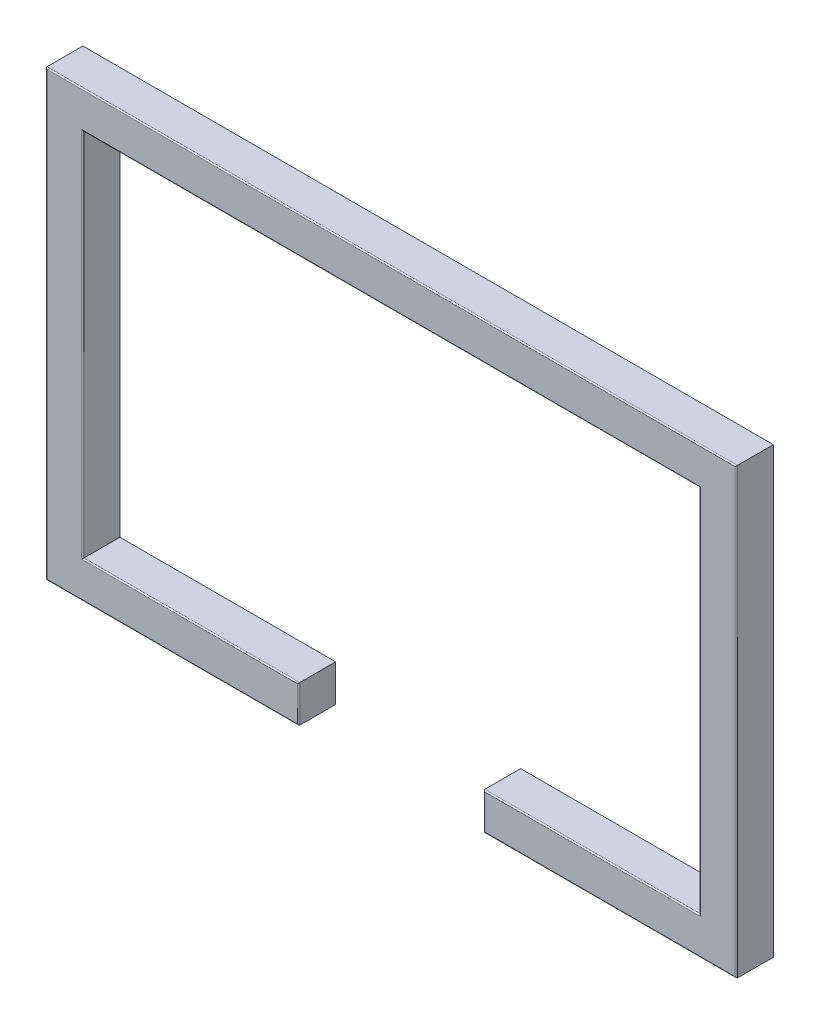
ISO-10303-21;
HEADER;
FILE_DESCRIPTION(('STEP AP214'),'2;1');
FILE_NAME('part.step','',(''),(''),'','','');
FILE_SCHEMA(('AUTOMOTIVE_DESIGN { 1 0 10303 214 1 1 1 1 }'));
ENDSEC;
DATA;
#1=APPLICATION_CONTEXT('core data for automotive mechanical design processes');
#2=APPLICATION_PROTOCOL_DEFINITION('international standard','automotive_design',2000,#1);
#3=PRODUCT_CONTEXT('',#1,'mechanical');
#4=PRODUCT('Part','Part','',(#3));
#5=PRODUCT_RELATED_PRODUCT_CATEGORY('part','',(#4));
#6=PRODUCT_DEFINITION_FORMATION('','',#4);
#7=PRODUCT_DEFINITION_CONTEXT('part definition',#1,'design');
#8=PRODUCT_DEFINITION('design','',#6,#7);
#9=PRODUCT_DEFINITION_SHAPE('','',#8);
#10=(LENGTH_UNIT() NAMED_UNIT(*) SI_UNIT(.MILLI.,.METRE.));
#11=(NAMED_UNIT(*) PLANE_ANGLE_UNIT() SI_UNIT($,.RADIAN.));
#12=(NAMED_UNIT(*) SI_UNIT($,.STERADIAN.) SOLID_ANGLE_UNIT());
#13=UNCERTAINTY_MEASURE_WITH_UNIT(LENGTH_MEASURE(1.E-05),#10,'distance_accuracy_value','');
#14=(GEOMETRIC_REPRESENTATION_CONTEXT(3) GLOBAL_UNCERTAINTY_ASSIGNED_CONTEXT((#13)) GLOBAL_UNIT_ASSIGNED_CONTEXT((#10,
#11,#12)) REPRESENTATION_CONTEXT('',''));
#15=CARTESIAN_POINT('',(0.,0.,0.));
#16=DIRECTION('',(0.,0.,1.));
#17=DIRECTION('',(1.,0.,0.));
#18=AXIS2_PLACEMENT_3D('',#15,#16,#17);
#19=CARTESIAN_POINT('',(75.,-150.,30.));
#20=DIRECTION('',(0.,-1.,0.));
#21=DIRECTION('',(0.,0.,-1.));
#22=AXIS2_PLACEMENT_3D('',#19,#20,#21);
#23=PLANE('',#22);
#24=DIRECTION('',(0.,0.,-1.));
#25=VECTOR('',#24,1.);
#26=CARTESIAN_POINT('',(75.,-150.,30.));
#27=LINE('',#26,#25);
#28=CARTESIAN_POINT('',(75.,-150.,29.));
#29=VERTEX_POINT('',#28);
#30=CARTESIAN_POINT('',(75.,-150.,0.));
#31=VERTEX_POINT('',#30);
#32=EDGE_CURVE('E159',#29,#31,#27,.T.);
#33=ORIENTED_EDGE('',*,*,#32,.F.);
#34=DIRECTION('',(-1.,0.,0.));
#35=VECTOR('',#34,1.);
#36=CARTESIAN_POINT('',(75.,-150.,29.));
#37=LINE('',#36,#35);
#38=CARTESIAN_POINT('',(250.,-150.,29.));
#39=VERTEX_POINT('',#38);
#40=EDGE_CURVE('E271',#29,#39,#37,.F.);
#41=ORIENTED_EDGE('',*,*,#40,.T.);
#42=DIRECTION('',(0.,0.,-1.));
#43=VECTOR('',#42,1.);
#44=CARTESIAN_POINT('',(250.,-150.,30.));
#45=LINE('',#44,#43);
#46=CARTESIAN_POINT('',(250.,-150.,0.));
#47=VERTEX_POINT('',#46);
#48=EDGE_CURVE('E183',#39,#47,#45,.T.);
#49=ORIENTED_EDGE('',*,*,#48,.T.);
#50=DIRECTION('',(-1.,0.,0.));
#51=VECTOR('',#50,1.);
#52=CARTESIAN_POINT('',(75.,-150.,0.));
#53=LINE('',#52,#51);
#54=EDGE_CURVE('E177',#47,#31,#53,.T.);
#55=ORIENTED_EDGE('',*,*,#54,.T.);
#56=EDGE_LOOP('',(#33,#41,#49,#55));
#57=FACE_BOUND('',#56,.T.);
#58=ADVANCED_FACE('F33',(#57),#23,.F.);
#59=CARTESIAN_POINT('',(75.,-180.,30.));
#60=DIRECTION('',(1.,0.,0.));
#61=DIRECTION('',(0.,0.,-1.));
#62=AXIS2_PLACEMENT_3D('',#59,#60,#61);
#63=PLANE('',#62);
#64=DIRECTION('',(0.,0.,-1.));
#65=VECTOR('',#64,1.);
#66=CARTESIAN_POINT('',(75.,-180.,30.));
#67=LINE('',#66,#65);
#68=CARTESIAN_POINT('',(75.,-180.,29.));
#69=VERTEX_POINT('',#68);
#70=CARTESIAN_POINT('',(75.,-180.,0.));
#71=VERTEX_POINT('',#70);
#72=EDGE_CURVE('E171',#69,#71,#67,.T.);
#73=ORIENTED_EDGE('',*,*,#72,.F.);
#74=DIRECTION('',(0.,-1.,0.));
#75=VECTOR('',#74,1.);
#76=CARTESIAN_POINT('',(75.,-180.,29.));
#77=LINE('',#76,#75);
#78=EDGE_CURVE('E166',#69,#29,#77,.F.);
#79=ORIENTED_EDGE('',*,*,#78,.T.);
#80=ORIENTED_EDGE('',*,*,#32,.T.);
#81=DIRECTION('',(0.,-1.,0.));
#82=VECTOR('',#81,1.);
#83=CARTESIAN_POINT('',(75.,-180.,0.));
#84=LINE('',#83,#82);
#85=EDGE_CURVE('E163',#31,#71,#84,.T.);
#86=ORIENTED_EDGE('',*,*,#85,.T.);
#87=EDGE_LOOP('',(#73,#79,#80,#86));
#88=FACE_BOUND('',#87,.T.);
#89=ADVANCED_FACE('F162',(#88),#63,.F.);
#90=CARTESIAN_POINT('',(75.,-180.,30.));
#91=DIRECTION('',(0.,1.,0.));
#92=DIRECTION('',(0.,0.,1.));
#93=AXIS2_PLACEMENT_3D('',#90,#91,#92);
#94=PLANE('',#93);
#95=DIRECTION('',(0.,0.,-1.));
#96=VECTOR('',#95,1.);
#97=CARTESIAN_POINT('',(280.,-180.,30.));
#98=LINE('',#97,#96);
#99=CARTESIAN_POINT('',(280.,-180.,29.));
#100=VERTEX_POINT('',#99);
#101=CARTESIAN_POINT('',(280.,-180.,0.));
#102=VERTEX_POINT('',#101);
#103=EDGE_CURVE('E233',#100,#102,#98,.T.);
#104=ORIENTED_EDGE('',*,*,#103,.F.);
#105=DIRECTION('',(1.,0.,0.));
#106=VECTOR('',#105,1.);
#107=CARTESIAN_POINT('',(75.,-180.,29.));
#108=LINE('',#107,#106);
#109=EDGE_CURVE('E276',#100,#69,#108,.F.);
#110=ORIENTED_EDGE('',*,*,#109,.T.);
#111=ORIENTED_EDGE('',*,*,#72,.T.);
#112=DIRECTION('',(1.,0.,0.));
#113=VECTOR('',#112,1.);
#114=CARTESIAN_POINT('',(75.,-180.,0.));
#115=LINE('',#114,#113);
#116=EDGE_CURVE('E180',#71,#102,#115,.T.);
#117=ORIENTED_EDGE('',*,*,#116,.T.);
#118=EDGE_LOOP('',(#104,#110,#111,#117));
#119=FACE_BOUND('',#118,.T.);
#120=ADVANCED_FACE('F358',(#119),#94,.F.);
#121=CARTESIAN_POINT('',(280.,180.,30.));
#122=DIRECTION('',(-1.,0.,0.));
#123=DIRECTION('',(0.,0.,1.));
#124=AXIS2_PLACEMENT_3D('',#121,#122,#123);
#125=PLANE('',#124);
#126=DIRECTION('',(0.,0.,-1.));
#127=VECTOR('',#126,1.);
#128=CARTESIAN_POINT('',(280.,180.,30.));
#129=LINE('',#128,#127);
#130=CARTESIAN_POINT('',(280.,180.,29.));
#131=VERTEX_POINT('',#130);
#132=CARTESIAN_POINT('',(280.,180.,0.));
#133=VERTEX_POINT('',#132);
#134=EDGE_CURVE('E231',#131,#133,#129,.T.);
#135=ORIENTED_EDGE('',*,*,#134,.F.);
#136=DIRECTION('',(0.,1.,0.));
#137=VECTOR('',#136,1.);
#138=CARTESIAN_POINT('',(280.,180.,29.));
#139=LINE('',#138,#137);
#140=EDGE_CURVE('E274',#131,#100,#139,.F.);
#141=ORIENTED_EDGE('',*,*,#140,.T.);
#142=ORIENTED_EDGE('',*,*,#103,.T.);
#143=DIRECTION('',(0.,1.,0.));
#144=VECTOR('',#143,1.);
#145=CARTESIAN_POINT('',(280.,180.,0.));
#146=LINE('',#145,#144);
#147=EDGE_CURVE('E190',#102,#133,#146,.T.);
#148=ORIENTED_EDGE('',*,*,#147,.T.);
#149=EDGE_LOOP('',(#135,#141,#142,#148));
#150=FACE_BOUND('',#149,.T.);
#151=ADVANCED_FACE('F434',(#150),#125,.F.);
#152=CARTESIAN_POINT('',(-280.,180.,30.));
#153=DIRECTION('',(0.,-1.,0.));
#154=DIRECTION('',(0.,0.,-1.));
#155=AXIS2_PLACEMENT_3D('',#152,#153,#154);
#156=PLANE('',#155);
#157=DIRECTION('',(0.,0.,-1.));
#158=VECTOR('',#157,1.);
#159=CARTESIAN_POINT('',(-280.,180.,30.));
#160=LINE('',#159,#158);
#161=CARTESIAN_POINT('',(-280.,180.,29.));
#162=VERTEX_POINT('',#161);
#163=CARTESIAN_POINT('',(-280.,180.,0.));
#164=VERTEX_POINT('',#163);
#165=EDGE_CURVE('E229',#162,#164,#160,.T.);
#166=ORIENTED_EDGE('',*,*,#165,.F.);
#167=DIRECTION('',(-1.,0.,0.));
#168=VECTOR('',#167,1.);
#169=CARTESIAN_POINT('',(-280.,180.,29.));
#170=LINE('',#169,#168);
#171=EDGE_CURVE('E11',#162,#131,#170,.F.);
#172=ORIENTED_EDGE('',*,*,#171,.T.);
#173=ORIENTED_EDGE('',*,*,#134,.T.);
#174=DIRECTION('',(-1.,0.,0.));
#175=VECTOR('',#174,1.);
#176=CARTESIAN_POINT('',(-280.,180.,0.));
#177=LINE('',#176,#175);
#178=EDGE_CURVE('E193',#133,#164,#177,.T.);
#179=ORIENTED_EDGE('',*,*,#178,.T.);
#180=EDGE_LOOP('',(#166,#172,#173,#179));
#181=FACE_BOUND('',#180,.T.);
#182=ADVANCED_FACE('F431',(#181),#156,.F.);
#183=CARTESIAN_POINT('',(-280.,180.,30.));
#184=DIRECTION('',(1.,0.,0.));
#185=DIRECTION('',(0.,0.,-1.));
#186=AXIS2_PLACEMENT_3D('',#183,#184,#185);
#187=PLANE('',#186);
#188=DIRECTION('',(0.,0.,-1.));
#189=VECTOR('',#188,1.);
#190=CARTESIAN_POINT('',(-280.,-180.,30.));
#191=LINE('',#190,#189);
#192=CARTESIAN_POINT('',(-280.,-180.,29.));
#193=VERTEX_POINT('',#192);
#194=CARTESIAN_POINT('',(-280.,-180.,0.));
#195=VERTEX_POINT('',#194);
#196=EDGE_CURVE('E227',#193,#195,#191,.T.);
#197=ORIENTED_EDGE('',*,*,#196,.F.);
#198=DIRECTION('',(0.,-1.,0.));
#199=VECTOR('',#198,1.);
#200=CARTESIAN_POINT('',(-280.,180.,29.));
#201=LINE('',#200,#199);
#202=EDGE_CURVE('E42',#193,#162,#201,.F.);
#203=ORIENTED_EDGE('',*,*,#202,.T.);
#204=ORIENTED_EDGE('',*,*,#165,.T.);
#205=DIRECTION('',(0.,-1.,0.));
#206=VECTOR('',#205,1.);
#207=CARTESIAN_POINT('',(-280.,180.,0.));
#208=LINE('',#207,#206);
#209=EDGE_CURVE('E196',#164,#195,#208,.T.);
#210=ORIENTED_EDGE('',*,*,#209,.T.);
#211=EDGE_LOOP('',(#197,#203,#204,#210));
#212=FACE_BOUND('',#211,.T.);
#213=ADVANCED_FACE('F429',(#212),#187,.F.);
#214=CARTESIAN_POINT('',(-280.,-180.,30.));
#215=DIRECTION('',(0.,1.,0.));
#216=DIRECTION('',(-1.,0.,0.));
#217=AXIS2_PLACEMENT_3D('',#214,#215,#216);
#218=PLANE('',#217);
#219=DIRECTION('',(0.,0.,-1.));
#220=VECTOR('',#219,1.);
#221=CARTESIAN_POINT('',(-75.,-180.,30.));
#222=LINE('',#221,#220);
#223=CARTESIAN_POINT('',(-75.,-180.,29.));
#224=VERTEX_POINT('',#223);
#225=CARTESIAN_POINT('',(-75.,-180.,0.));
#226=VERTEX_POINT('',#225);
#227=EDGE_CURVE('E225',#224,#226,#222,.T.);
#228=ORIENTED_EDGE('',*,*,#227,.F.);
#229=DIRECTION('',(1.,0.,0.));
#230=VECTOR('',#229,1.);
#231=CARTESIAN_POINT('',(-280.,-180.,29.));
#232=LINE('',#231,#230);
#233=EDGE_CURVE('E57',#224,#193,#232,.F.);
#234=ORIENTED_EDGE('',*,*,#233,.T.);
#235=ORIENTED_EDGE('',*,*,#196,.T.);
#236=DIRECTION('',(1.,0.,0.));
#237=VECTOR('',#236,1.);
#238=CARTESIAN_POINT('',(-280.,-180.,0.));
#239=LINE('',#238,#237);
#240=EDGE_CURVE('E199',#195,#226,#239,.T.);
#241=ORIENTED_EDGE('',*,*,#240,.T.);
#242=EDGE_LOOP('',(#228,#234,#235,#241));
#243=FACE_BOUND('',#242,.T.);
#244=ADVANCED_FACE('F428',(#243),#218,.F.);
#245=CARTESIAN_POINT('',(-75.,-180.,30.));
#246=DIRECTION('',(-1.,0.,0.));
#247=DIRECTION('',(0.,0.,1.));
#248=AXIS2_PLACEMENT_3D('',#245,#246,#247);
#249=PLANE('',#248);
#250=DIRECTION('',(0.,0.,-1.));
#251=VECTOR('',#250,1.);
#252=CARTESIAN_POINT('',(-75.,-150.,30.));
#253=LINE('',#252,#251);
#254=CARTESIAN_POINT('',(-75.,-150.,29.));
#255=VERTEX_POINT('',#254);
#256=CARTESIAN_POINT('',(-75.,-150.,0.));
#257=VERTEX_POINT('',#256);
#258=EDGE_CURVE('E223',#255,#257,#253,.T.);
#259=ORIENTED_EDGE('',*,*,#258,.F.);
#260=DIRECTION('',(0.,1.,0.));
#261=VECTOR('',#260,1.);
#262=CARTESIAN_POINT('',(-75.,-180.,29.));
#263=LINE('',#262,#261);
#264=EDGE_CURVE('E260',#255,#224,#263,.F.);
#265=ORIENTED_EDGE('',*,*,#264,.T.);
#266=ORIENTED_EDGE('',*,*,#227,.T.);
#267=DIRECTION('',(0.,1.,0.));
#268=VECTOR('',#267,1.);
#269=CARTESIAN_POINT('',(-75.,-180.,0.));
#270=LINE('',#269,#268);
#271=EDGE_CURVE('E202',#226,#257,#270,.T.);
#272=ORIENTED_EDGE('',*,*,#271,.T.);
#273=EDGE_LOOP('',(#259,#265,#266,#272));
#274=FACE_BOUND('',#273,.T.);
#275=ADVANCED_FACE('F423',(#274),#249,.F.);
#276=CARTESIAN_POINT('',(-250.,-150.,30.));
#277=DIRECTION('',(0.,-1.,0.));
#278=DIRECTION('',(0.,0.,-1.));
#279=AXIS2_PLACEMENT_3D('',#276,#277,#278);
#280=PLANE('',#279);
#281=DIRECTION('',(0.,0.,-1.));
#282=VECTOR('',#281,1.);
#283=CARTESIAN_POINT('',(-250.,-150.,30.));
#284=LINE('',#283,#282);
#285=CARTESIAN_POINT('',(-250.,-150.,29.));
#286=VERTEX_POINT('',#285);
#287=CARTESIAN_POINT('',(-250.,-150.,0.));
#288=VERTEX_POINT('',#287);
#289=EDGE_CURVE('E221',#286,#288,#284,.T.);
#290=ORIENTED_EDGE('',*,*,#289,.F.);
#291=DIRECTION('',(-1.,0.,0.));
#292=VECTOR('',#291,1.);
#293=CARTESIAN_POINT('',(-250.,-150.,29.));
#294=LINE('',#293,#292);
#295=EDGE_CURVE('E263',#286,#255,#294,.F.);
#296=ORIENTED_EDGE('',*,*,#295,.T.);
#297=ORIENTED_EDGE('',*,*,#258,.T.);
#298=DIRECTION('',(-1.,0.,0.));
#299=VECTOR('',#298,1.);
#300=CARTESIAN_POINT('',(-250.,-150.,0.));
#301=LINE('',#300,#299);
#302=EDGE_CURVE('E205',#257,#288,#301,.T.);
#303=ORIENTED_EDGE('',*,*,#302,.T.);
#304=EDGE_LOOP('',(#290,#296,#297,#303));
#305=FACE_BOUND('',#304,.T.);
#306=ADVANCED_FACE('F421',(#305),#280,.F.);
#307=CARTESIAN_POINT('',(-250.,150.,30.));
#308=DIRECTION('',(-1.,0.,0.));
#309=DIRECTION('',(0.,-1.,0.));
#310=AXIS2_PLACEMENT_3D('',#307,#308,#309);
#311=PLANE('',#310);
#312=DIRECTION('',(0.,0.,-1.));
#313=VECTOR('',#312,1.);
#314=CARTESIAN_POINT('',(-250.,150.,30.));
#315=LINE('',#314,#313);
#316=CARTESIAN_POINT('',(-250.,150.,29.));
#317=VERTEX_POINT('',#316);
#318=CARTESIAN_POINT('',(-250.,150.,0.));
#319=VERTEX_POINT('',#318);
#320=EDGE_CURVE('E219',#317,#319,#315,.T.);
#321=ORIENTED_EDGE('',*,*,#320,.F.);
#322=DIRECTION('',(0.,1.,0.));
#323=VECTOR('',#322,1.);
#324=CARTESIAN_POINT('',(-250.,150.,29.));
#325=LINE('',#324,#323);
#326=EDGE_CURVE('E265',#317,#286,#325,.F.);
#327=ORIENTED_EDGE('',*,*,#326,.T.);
#328=ORIENTED_EDGE('',*,*,#289,.T.);
#329=DIRECTION('',(0.,1.,0.));
#330=VECTOR('',#329,1.);
#331=CARTESIAN_POINT('',(-250.,150.,0.));
#332=LINE('',#331,#330);
#333=EDGE_CURVE('E208',#288,#319,#332,.T.);
#334=ORIENTED_EDGE('',*,*,#333,.T.);
#335=EDGE_LOOP('',(#321,#327,#328,#334));
#336=FACE_BOUND('',#335,.T.);
#337=ADVANCED_FACE('F336',(#336),#311,.F.);
#338=CARTESIAN_POINT('',(-250.,150.,30.));
#339=DIRECTION('',(0.,1.,0.));
#340=DIRECTION('',(0.,0.,1.));
#341=AXIS2_PLACEMENT_3D('',#338,#339,#340);
#342=PLANE('',#341);
#343=DIRECTION('',(0.,0.,-1.));
#344=VECTOR('',#343,1.);
#345=CARTESIAN_POINT('',(250.,150.,30.));
#346=LINE('',#345,#344);
#347=CARTESIAN_POINT('',(250.,150.,29.));
#348=VERTEX_POINT('',#347);
#349=CARTESIAN_POINT('',(250.,150.,0.));
#350=VERTEX_POINT('',#349);
#351=EDGE_CURVE('E217',#348,#350,#346,.T.);
#352=ORIENTED_EDGE('',*,*,#351,.F.);
#353=DIRECTION('',(1.,0.,0.));
#354=VECTOR('',#353,1.);
#355=CARTESIAN_POINT('',(-250.,150.,29.));
#356=LINE('',#355,#354);
#357=EDGE_CURVE('E267',#348,#317,#356,.F.);
#358=ORIENTED_EDGE('',*,*,#357,.T.);
#359=ORIENTED_EDGE('',*,*,#320,.T.);
#360=DIRECTION('',(1.,0.,0.));
#361=VECTOR('',#360,1.);
#362=CARTESIAN_POINT('',(-250.,150.,0.));
#363=LINE('',#362,#361);
#364=EDGE_CURVE('E211',#319,#350,#363,.T.);
#365=ORIENTED_EDGE('',*,*,#364,.T.);
#366=EDGE_LOOP('',(#352,#358,#359,#365));
#367=FACE_BOUND('',#366,.T.);
#368=ADVANCED_FACE('F334',(#367),#342,.F.);
#369=CARTESIAN_POINT('',(250.,150.,30.));
#370=DIRECTION('',(1.,0.,0.));
#371=DIRECTION('',(0.,1.,0.));
#372=AXIS2_PLACEMENT_3D('',#369,#370,#371);
#373=PLANE('',#372);
#374=ORIENTED_EDGE('',*,*,#48,.F.);
#375=DIRECTION('',(0.,-1.,0.));
#376=VECTOR('',#375,1.);
#377=CARTESIAN_POINT('',(250.,150.,29.));
#378=LINE('',#377,#376);
#379=EDGE_CURVE('E269',#39,#348,#378,.F.);
#380=ORIENTED_EDGE('',*,*,#379,.T.);
#381=ORIENTED_EDGE('',*,*,#351,.T.);
#382=DIRECTION('',(0.,-1.,0.));
#383=VECTOR('',#382,1.);
#384=CARTESIAN_POINT('',(250.,150.,0.));
#385=LINE('',#384,#383);
#386=EDGE_CURVE('E214',#350,#47,#385,.T.);
#387=ORIENTED_EDGE('',*,*,#386,.T.);
#388=EDGE_LOOP('',(#374,#380,#381,#387));
#389=FACE_BOUND('',#388,.T.);
#390=ADVANCED_FACE('F342',(#389),#373,.F.);
#391=CARTESIAN_POINT('',(0.,0.,30.));
#392=DIRECTION('',(0.,0.,-1.));
#393=DIRECTION('',(-1.,0.,0.));
#394=AXIS2_PLACEMENT_3D('',#391,#392,#393);
#395=PLANE('',#394);
#396=DIRECTION('',(0.,1.,0.));
#397=VECTOR('',#396,1.);
#398=CARTESIAN_POINT('',(-76.,0.,30.));
#399=LINE('',#398,#397);
#400=CARTESIAN_POINT('',(-76.,-179.,30.));
#401=VERTEX_POINT('',#400);
#402=CARTESIAN_POINT('',(-76.,-151.,30.));
#403=VERTEX_POINT('',#402);
#404=EDGE_CURVE('E243',#401,#403,#399,.T.);
#405=ORIENTED_EDGE('',*,*,#404,.T.);
#406=DIRECTION('',(-1.,0.,0.));
#407=VECTOR('',#406,1.);
#408=CARTESIAN_POINT('',(0.,-151.,30.));
#409=LINE('',#408,#407);
#410=CARTESIAN_POINT('',(-251.,-151.,30.));
#411=VERTEX_POINT('',#410);
#412=EDGE_CURVE('E258',#403,#411,#409,.T.);
#413=ORIENTED_EDGE('',*,*,#412,.T.);
#414=DIRECTION('',(0.,1.,0.));
#415=VECTOR('',#414,1.);
#416=CARTESIAN_POINT('',(-251.,0.,30.));
#417=LINE('',#416,#415);
#418=CARTESIAN_POINT('',(-251.,151.,30.));
#419=VERTEX_POINT('',#418);
#420=EDGE_CURVE('E256',#411,#419,#417,.T.);
#421=ORIENTED_EDGE('',*,*,#420,.T.);
#422=DIRECTION('',(1.,0.,0.));
#423=VECTOR('',#422,1.);
#424=CARTESIAN_POINT('',(0.,151.,30.));
#425=LINE('',#424,#423);
#426=CARTESIAN_POINT('',(251.,151.,30.));
#427=VERTEX_POINT('',#426);
#428=EDGE_CURVE('E254',#419,#427,#425,.T.);
#429=ORIENTED_EDGE('',*,*,#428,.T.);
#430=DIRECTION('',(0.,-1.,0.));
#431=VECTOR('',#430,1.);
#432=CARTESIAN_POINT('',(251.,0.,30.));
#433=LINE('',#432,#431);
#434=CARTESIAN_POINT('',(251.,-151.,30.));
#435=VERTEX_POINT('',#434);
#436=EDGE_CURVE('E252',#427,#435,#433,.T.);
#437=ORIENTED_EDGE('',*,*,#436,.T.);
#438=DIRECTION('',(-1.,0.,0.));
#439=VECTOR('',#438,1.);
#440=CARTESIAN_POINT('',(0.,-151.,30.));
#441=LINE('',#440,#439);
#442=CARTESIAN_POINT('',(76.,-151.,30.));
#443=VERTEX_POINT('',#442);
#444=EDGE_CURVE('E250',#435,#443,#441,.T.);
#445=ORIENTED_EDGE('',*,*,#444,.T.);
#446=DIRECTION('',(0.,-1.,0.));
#447=VECTOR('',#446,1.);
#448=CARTESIAN_POINT('',(76.,0.,30.));
#449=LINE('',#448,#447);
#450=CARTESIAN_POINT('',(76.,-179.,30.));
#451=VERTEX_POINT('',#450);
#452=EDGE_CURVE('E248',#443,#451,#449,.T.);
#453=ORIENTED_EDGE('',*,*,#452,.T.);
#454=DIRECTION('',(1.,0.,0.));
#455=VECTOR('',#454,1.);
#456=CARTESIAN_POINT('',(0.,-179.,30.));
#457=LINE('',#456,#455);
#458=CARTESIAN_POINT('',(279.,-179.,30.));
#459=VERTEX_POINT('',#458);
#460=EDGE_CURVE('E246',#451,#459,#457,.T.);
#461=ORIENTED_EDGE('',*,*,#460,.T.);
#462=DIRECTION('',(0.,1.,0.));
#463=VECTOR('',#462,1.);
#464=CARTESIAN_POINT('',(279.,0.,30.));
#465=LINE('',#464,#463);
#466=CARTESIAN_POINT('',(279.,179.,30.));
#467=VERTEX_POINT('',#466);
#468=EDGE_CURVE('E241',#459,#467,#465,.T.);
#469=ORIENTED_EDGE('',*,*,#468,.T.);
#470=DIRECTION('',(-1.,0.,0.));
#471=VECTOR('',#470,1.);
#472=CARTESIAN_POINT('',(0.,179.,30.));
#473=LINE('',#472,#471);
#474=CARTESIAN_POINT('',(-279.,179.,30.));
#475=VERTEX_POINT('',#474);
#476=EDGE_CURVE('E170',#467,#475,#473,.T.);
#477=ORIENTED_EDGE('',*,*,#476,.T.);
#478=DIRECTION('',(0.,-1.,0.));
#479=VECTOR('',#478,1.);
#480=CARTESIAN_POINT('',(-279.,0.,30.));
#481=LINE('',#480,#479);
#482=CARTESIAN_POINT('',(-279.,-179.,30.));
#483=VERTEX_POINT('',#482);
#484=EDGE_CURVE('E237',#475,#483,#481,.T.);
#485=ORIENTED_EDGE('',*,*,#484,.T.);
#486=DIRECTION('',(1.,0.,0.));
#487=VECTOR('',#486,1.);
#488=CARTESIAN_POINT('',(0.,-179.,30.));
#489=LINE('',#488,#487);
#490=EDGE_CURVE('E239',#483,#401,#489,.T.);
#491=ORIENTED_EDGE('',*,*,#490,.T.);
#492=EDGE_LOOP('',(#405,#413,#421,#429,#437,#445,#453,#461,#469,#477,#485,#491));
#493=FACE_BOUND('',#492,.T.);
#494=ADVANCED_FACE('F318',(#493),#395,.F.);
#495=CARTESIAN_POINT('',(0.,0.,0.));
#496=DIRECTION('',(0.,0.,-1.));
#497=DIRECTION('',(-1.,0.,0.));
#498=AXIS2_PLACEMENT_3D('',#495,#496,#497);
#499=PLANE('',#498);
#500=ORIENTED_EDGE('',*,*,#54,.F.);
#501=ORIENTED_EDGE('',*,*,#386,.F.);
#502=ORIENTED_EDGE('',*,*,#364,.F.);
#503=ORIENTED_EDGE('',*,*,#333,.F.);
#504=ORIENTED_EDGE('',*,*,#302,.F.);
#505=ORIENTED_EDGE('',*,*,#271,.F.);
#506=ORIENTED_EDGE('',*,*,#240,.F.);
#507=ORIENTED_EDGE('',*,*,#209,.F.);
#508=ORIENTED_EDGE('',*,*,#178,.F.);
#509=ORIENTED_EDGE('',*,*,#147,.F.);
#510=ORIENTED_EDGE('',*,*,#116,.F.);
#511=ORIENTED_EDGE('',*,*,#85,.F.);
#512=EDGE_LOOP('',(#500,#501,#502,#503,#504,#505,#506,#507,#508,#509,#510,#511));
#513=FACE_BOUND('',#512,.T.);
#514=ADVANCED_FACE('F175',(#513),#499,.T.);
#515=CARTESIAN_POINT('',(76.,0.,29.));
#516=DIRECTION('',(0.,-1.,0.));
#517=DIRECTION('',(0.,0.,-1.));
#518=AXIS2_PLACEMENT_3D('',#515,#516,#517);
#519=CYLINDRICAL_SURFACE('',#518,1.);
#520=CARTESIAN_POINT('',(76.,-151.,29.));
#521=DIRECTION('',(-0.707106781186547,-0.707106781186547,0.));
#522=DIRECTION('',(0.707106781186547,-0.707106781186547,0.));
#523=AXIS2_PLACEMENT_3D('',#520,#521,#522);
#524=ELLIPSE('',#523,1.41421356237309,1.);
#525=EDGE_CURVE('E187',#29,#443,#524,.F.);
#526=ORIENTED_EDGE('',*,*,#525,.F.);
#527=ORIENTED_EDGE('',*,*,#78,.F.);
#528=CARTESIAN_POINT('',(76.,-179.,29.));
#529=DIRECTION('',(0.707106781186547,-0.707106781186547,0.));
#530=DIRECTION('',(0.707106781186547,0.707106781186547,0.));
#531=AXIS2_PLACEMENT_3D('',#528,#529,#530);
#532=ELLIPSE('',#531,1.41421356237309,1.);
#533=EDGE_CURVE('E37',#451,#69,#532,.T.);
#534=ORIENTED_EDGE('',*,*,#533,.F.);
#535=ORIENTED_EDGE('',*,*,#452,.F.);
#536=EDGE_LOOP('',(#526,#527,#534,#535));
#537=FACE_BOUND('',#536,.T.);
#538=ADVANCED_FACE('F35',(#537),#519,.T.);
#539=CARTESIAN_POINT('',(0.,-179.,29.));
#540=DIRECTION('',(1.,0.,0.));
#541=DIRECTION('',(0.,0.,-1.));
#542=AXIS2_PLACEMENT_3D('',#539,#540,#541);
#543=CYLINDRICAL_SURFACE('',#542,1.);
#544=ORIENTED_EDGE('',*,*,#533,.T.);
#545=ORIENTED_EDGE('',*,*,#109,.F.);
#546=CARTESIAN_POINT('',(279.,-179.,29.));
#547=DIRECTION('',(0.707106781186547,0.707106781186547,0.));
#548=DIRECTION('',(0.707106781186547,-0.707106781186547,0.));
#549=AXIS2_PLACEMENT_3D('',#546,#547,#548);
#550=ELLIPSE('',#549,1.41421356237309,1.);
#551=EDGE_CURVE('E305',#459,#100,#550,.T.);
#552=ORIENTED_EDGE('',*,*,#551,.F.);
#553=ORIENTED_EDGE('',*,*,#460,.F.);
#554=EDGE_LOOP('',(#544,#545,#552,#553));
#555=FACE_BOUND('',#554,.T.);
#556=ADVANCED_FACE('F395',(#555),#543,.T.);
#557=CARTESIAN_POINT('',(0.,-151.,29.));
#558=DIRECTION('',(-1.,0.,0.));
#559=DIRECTION('',(0.,0.,1.));
#560=AXIS2_PLACEMENT_3D('',#557,#558,#559);
#561=CYLINDRICAL_SURFACE('',#560,1.);
#562=ORIENTED_EDGE('',*,*,#525,.T.);
#563=ORIENTED_EDGE('',*,*,#444,.F.);
#564=CARTESIAN_POINT('',(251.,-151.,29.));
#565=DIRECTION('',(-0.707106781186547,-0.707106781186548,0.));
#566=DIRECTION('',(0.707106781186548,-0.707106781186547,0.));
#567=AXIS2_PLACEMENT_3D('',#564,#565,#566);
#568=ELLIPSE('',#567,1.4142135623731,1.);
#569=EDGE_CURVE('E302',#39,#435,#568,.F.);
#570=ORIENTED_EDGE('',*,*,#569,.F.);
#571=ORIENTED_EDGE('',*,*,#40,.F.);
#572=EDGE_LOOP('',(#562,#563,#570,#571));
#573=FACE_BOUND('',#572,.T.);
#574=ADVANCED_FACE('F311',(#573),#561,.T.);
#575=CARTESIAN_POINT('',(279.,0.,29.));
#576=DIRECTION('',(0.,1.,0.));
#577=DIRECTION('',(0.,0.,1.));
#578=AXIS2_PLACEMENT_3D('',#575,#576,#577);
#579=CYLINDRICAL_SURFACE('',#578,1.);
#580=ORIENTED_EDGE('',*,*,#551,.T.);
#581=ORIENTED_EDGE('',*,*,#140,.F.);
#582=CARTESIAN_POINT('',(279.,179.,29.));
#583=DIRECTION('',(-0.707106781186547,0.707106781186547,0.));
#584=DIRECTION('',(-0.707106781186547,-0.707106781186547,0.));
#585=AXIS2_PLACEMENT_3D('',#582,#583,#584);
#586=ELLIPSE('',#585,1.41421356237309,1.);
#587=EDGE_CURVE('E299',#467,#131,#586,.T.);
#588=ORIENTED_EDGE('',*,*,#587,.F.);
#589=ORIENTED_EDGE('',*,*,#468,.F.);
#590=EDGE_LOOP('',(#580,#581,#588,#589));
#591=FACE_BOUND('',#590,.T.);
#592=ADVANCED_FACE('F390',(#591),#579,.T.);
#593=CARTESIAN_POINT('',(251.,0.,29.));
#594=DIRECTION('',(0.,-1.,0.));
#595=DIRECTION('',(1.,0.,0.));
#596=AXIS2_PLACEMENT_3D('',#593,#594,#595);
#597=CYLINDRICAL_SURFACE('',#596,1.);
#598=ORIENTED_EDGE('',*,*,#569,.T.);
#599=ORIENTED_EDGE('',*,*,#436,.F.);
#600=CARTESIAN_POINT('',(251.,151.,29.));
#601=DIRECTION('',(0.707106781186548,-0.707106781186547,0.));
#602=DIRECTION('',(0.707106781186547,0.707106781186548,0.));
#603=AXIS2_PLACEMENT_3D('',#600,#601,#602);
#604=ELLIPSE('',#603,1.41421356237309,1.);
#605=EDGE_CURVE('E296',#348,#427,#604,.F.);
#606=ORIENTED_EDGE('',*,*,#605,.F.);
#607=ORIENTED_EDGE('',*,*,#379,.F.);
#608=EDGE_LOOP('',(#598,#599,#606,#607));
#609=FACE_BOUND('',#608,.T.);
#610=ADVANCED_FACE('F324',(#609),#597,.T.);
#611=CARTESIAN_POINT('',(0.,179.,29.));
#612=DIRECTION('',(-1.,0.,0.));
#613=DIRECTION('',(0.,0.,1.));
#614=AXIS2_PLACEMENT_3D('',#611,#612,#613);
#615=CYLINDRICAL_SURFACE('',#614,1.);
#616=ORIENTED_EDGE('',*,*,#587,.T.);
#617=ORIENTED_EDGE('',*,*,#171,.F.);
#618=CARTESIAN_POINT('',(-279.,179.,29.));
#619=DIRECTION('',(-0.707106781186547,-0.707106781186547,0.));
#620=DIRECTION('',(-0.707106781186547,0.707106781186547,0.));
#621=AXIS2_PLACEMENT_3D('',#618,#619,#620);
#622=ELLIPSE('',#621,1.41421356237309,1.);
#623=EDGE_CURVE('E293',#475,#162,#622,.T.);
#624=ORIENTED_EDGE('',*,*,#623,.F.);
#625=ORIENTED_EDGE('',*,*,#476,.F.);
#626=EDGE_LOOP('',(#616,#617,#624,#625));
#627=FACE_BOUND('',#626,.T.);
#628=ADVANCED_FACE('F384',(#627),#615,.T.);
#629=CARTESIAN_POINT('',(0.,151.,29.));
#630=DIRECTION('',(1.,0.,0.));
#631=DIRECTION('',(0.,0.,-1.));
#632=AXIS2_PLACEMENT_3D('',#629,#630,#631);
#633=CYLINDRICAL_SURFACE('',#632,1.);
#634=ORIENTED_EDGE('',*,*,#605,.T.);
#635=ORIENTED_EDGE('',*,*,#428,.F.);
#636=CARTESIAN_POINT('',(-251.,151.,29.));
#637=DIRECTION('',(0.707106781186547,0.707106781186548,0.));
#638=DIRECTION('',(-0.707106781186548,0.707106781186547,0.));
#639=AXIS2_PLACEMENT_3D('',#636,#637,#638);
#640=ELLIPSE('',#639,1.4142135623731,1.);
#641=EDGE_CURVE('E290',#317,#419,#640,.F.);
#642=ORIENTED_EDGE('',*,*,#641,.F.);
#643=ORIENTED_EDGE('',*,*,#357,.F.);
#644=EDGE_LOOP('',(#634,#635,#642,#643));
#645=FACE_BOUND('',#644,.T.);
#646=ADVANCED_FACE('F328',(#645),#633,.T.);
#647=CARTESIAN_POINT('',(-279.,0.,29.));
#648=DIRECTION('',(0.,-1.,0.));
#649=DIRECTION('',(0.,0.,-1.));
#650=AXIS2_PLACEMENT_3D('',#647,#648,#649);
#651=CYLINDRICAL_SURFACE('',#650,1.);
#652=ORIENTED_EDGE('',*,*,#623,.T.);
#653=ORIENTED_EDGE('',*,*,#202,.F.);
#654=CARTESIAN_POINT('',(-279.,-179.,29.));
#655=DIRECTION('',(0.707106781186547,-0.707106781186548,0.));
#656=DIRECTION('',(-0.707106781186548,-0.707106781186547,0.));
#657=AXIS2_PLACEMENT_3D('',#654,#655,#656);
#658=ELLIPSE('',#657,1.41421356237309,1.);
#659=EDGE_CURVE('E287',#483,#193,#658,.T.);
#660=ORIENTED_EDGE('',*,*,#659,.F.);
#661=ORIENTED_EDGE('',*,*,#484,.F.);
#662=EDGE_LOOP('',(#652,#653,#660,#661));
#663=FACE_BOUND('',#662,.T.);
#664=ADVANCED_FACE('F377',(#663),#651,.T.);
#665=CARTESIAN_POINT('',(-251.,0.,29.));
#666=DIRECTION('',(0.,1.,0.));
#667=DIRECTION('',(-1.,0.,0.));
#668=AXIS2_PLACEMENT_3D('',#665,#666,#667);
#669=CYLINDRICAL_SURFACE('',#668,1.);
#670=ORIENTED_EDGE('',*,*,#641,.T.);
#671=ORIENTED_EDGE('',*,*,#420,.F.);
#672=CARTESIAN_POINT('',(-251.,-151.,29.));
#673=DIRECTION('',(-0.707106781186548,0.707106781186547,0.));
#674=DIRECTION('',(-0.707106781186547,-0.707106781186548,0.));
#675=AXIS2_PLACEMENT_3D('',#672,#673,#674);
#676=ELLIPSE('',#675,1.41421356237309,1.);
#677=EDGE_CURVE('E284',#286,#411,#676,.F.);
#678=ORIENTED_EDGE('',*,*,#677,.F.);
#679=ORIENTED_EDGE('',*,*,#326,.F.);
#680=EDGE_LOOP('',(#670,#671,#678,#679));
#681=FACE_BOUND('',#680,.T.);
#682=ADVANCED_FACE('F373',(#681),#669,.T.);
#683=CARTESIAN_POINT('',(0.,-179.,29.));
#684=DIRECTION('',(1.,0.,0.));
#685=DIRECTION('',(0.,1.,0.));
#686=AXIS2_PLACEMENT_3D('',#683,#684,#685);
#687=CYLINDRICAL_SURFACE('',#686,1.);
#688=ORIENTED_EDGE('',*,*,#659,.T.);
#689=ORIENTED_EDGE('',*,*,#233,.F.);
#690=CARTESIAN_POINT('',(-76.,-179.,29.));
#691=DIRECTION('',(0.707106781186548,0.707106781186547,0.));
#692=DIRECTION('',(0.707106781186547,-0.707106781186548,0.));
#693=AXIS2_PLACEMENT_3D('',#690,#691,#692);
#694=ELLIPSE('',#693,1.4142135623731,1.);
#695=EDGE_CURVE('E282',#401,#224,#694,.T.);
#696=ORIENTED_EDGE('',*,*,#695,.F.);
#697=ORIENTED_EDGE('',*,*,#490,.F.);
#698=EDGE_LOOP('',(#688,#689,#696,#697));
#699=FACE_BOUND('',#698,.T.);
#700=ADVANCED_FACE('F369',(#699),#687,.T.);
#701=CARTESIAN_POINT('',(0.,-151.,29.));
#702=DIRECTION('',(-1.,0.,0.));
#703=DIRECTION('',(0.,0.,1.));
#704=AXIS2_PLACEMENT_3D('',#701,#702,#703);
#705=CYLINDRICAL_SURFACE('',#704,1.);
#706=ORIENTED_EDGE('',*,*,#677,.T.);
#707=ORIENTED_EDGE('',*,*,#412,.F.);
#708=CARTESIAN_POINT('',(-76.,-151.,29.));
#709=DIRECTION('',(-0.707106781186547,0.707106781186547,0.));
#710=DIRECTION('',(-0.707106781186547,-0.707106781186547,0.));
#711=AXIS2_PLACEMENT_3D('',#708,#709,#710);
#712=ELLIPSE('',#711,1.41421356237309,1.);
#713=EDGE_CURVE('E280',#255,#403,#712,.F.);
#714=ORIENTED_EDGE('',*,*,#713,.F.);
#715=ORIENTED_EDGE('',*,*,#295,.F.);
#716=EDGE_LOOP('',(#706,#707,#714,#715));
#717=FACE_BOUND('',#716,.T.);
#718=ADVANCED_FACE('F365',(#717),#705,.T.);
#719=CARTESIAN_POINT('',(-76.,0.,29.));
#720=DIRECTION('',(0.,1.,0.));
#721=DIRECTION('',(0.,0.,1.));
#722=AXIS2_PLACEMENT_3D('',#719,#720,#721);
#723=CYLINDRICAL_SURFACE('',#722,1.);
#724=ORIENTED_EDGE('',*,*,#695,.T.);
#725=ORIENTED_EDGE('',*,*,#264,.F.);
#726=ORIENTED_EDGE('',*,*,#713,.T.);
#727=ORIENTED_EDGE('',*,*,#404,.F.);
#728=EDGE_LOOP('',(#724,#725,#726,#727));
#729=FACE_BOUND('',#728,.T.);
#730=ADVANCED_FACE('F362',(#729),#723,.T.);
#731=CLOSED_SHELL('',(#58,#89,#120,#151,#182,#213,#244,#275,#306,#337,#368,#390,#494,#514,#538,
#556,#574,#592,#610,#628,#646,#664,#682,#700,#718,#730));
#732=MANIFOLD_SOLID_BREP('B2',#731);
#733=ADVANCED_BREP_SHAPE_REPRESENTATION('',(#18,#732),#14);
#734=SHAPE_DEFINITION_REPRESENTATION(#9,#733);
ENDSEC;
END-ISO-10303-21;
